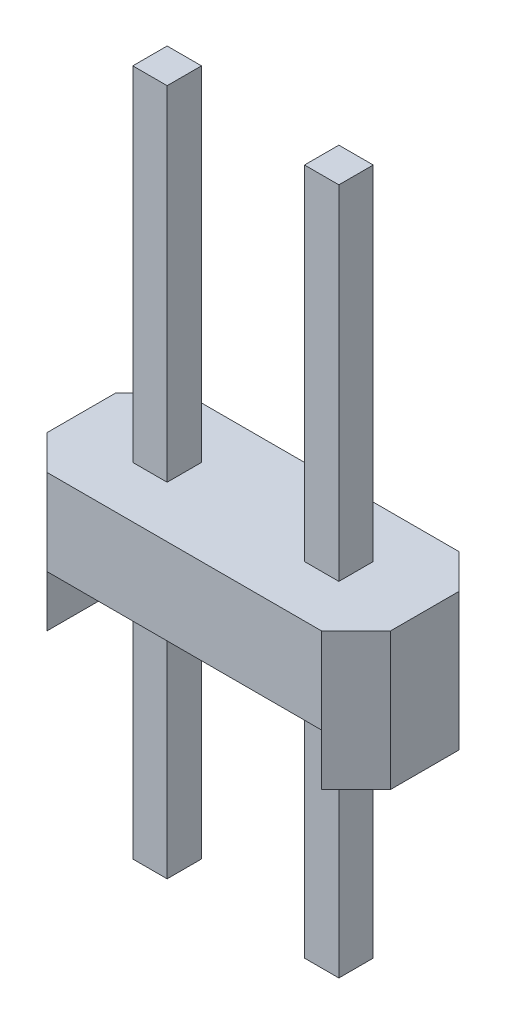
ISO-10303-21;
HEADER;
FILE_DESCRIPTION(('STEP AP214'),'2;1');
FILE_NAME('part.step','',(''),(''),'','','');
FILE_SCHEMA(('AUTOMOTIVE_DESIGN { 1 0 10303 214 1 1 1 1 }'));
ENDSEC;
DATA;
#1=APPLICATION_CONTEXT('core data for automotive mechanical design processes');
#2=APPLICATION_PROTOCOL_DEFINITION('international standard','automotive_design',2000,#1);
#3=PRODUCT_CONTEXT('',#1,'mechanical');
#4=PRODUCT('Part','Part','',(#3));
#5=PRODUCT_RELATED_PRODUCT_CATEGORY('part','',(#4));
#6=PRODUCT_DEFINITION_FORMATION('','',#4);
#7=PRODUCT_DEFINITION_CONTEXT('part definition',#1,'design');
#8=PRODUCT_DEFINITION('design','',#6,#7);
#9=PRODUCT_DEFINITION_SHAPE('','',#8);
#10=(LENGTH_UNIT() NAMED_UNIT(*) SI_UNIT(.MILLI.,.METRE.));
#11=(NAMED_UNIT(*) PLANE_ANGLE_UNIT() SI_UNIT($,.RADIAN.));
#12=(NAMED_UNIT(*) SI_UNIT($,.STERADIAN.) SOLID_ANGLE_UNIT());
#13=UNCERTAINTY_MEASURE_WITH_UNIT(LENGTH_MEASURE(1.E-05),#10,'distance_accuracy_value','');
#14=(GEOMETRIC_REPRESENTATION_CONTEXT(3) GLOBAL_UNCERTAINTY_ASSIGNED_CONTEXT((#13)) GLOBAL_UNIT_ASSIGNED_CONTEXT((#10,
#11,#12)) REPRESENTATION_CONTEXT('',''));
#15=CARTESIAN_POINT('',(0.,0.,0.));
#16=DIRECTION('',(0.,0.,1.));
#17=DIRECTION('',(1.,0.,0.));
#18=AXIS2_PLACEMENT_3D('',#15,#16,#17);
#19=CARTESIAN_POINT('',(0.,0.,0.));
#20=DIRECTION('',(0.,-1.,0.));
#21=DIRECTION('',(0.,0.,-1.));
#22=AXIS2_PLACEMENT_3D('',#19,#20,#21);
#23=PLANE('',#22);
#24=DIRECTION('',(0.,0.,1.));
#25=VECTOR('',#24,1.);
#26=CARTESIAN_POINT('',(0.,0.,0.));
#27=LINE('',#26,#25);
#28=CARTESIAN_POINT('',(0.,0.,-1.5));
#29=VERTEX_POINT('',#28);
#30=CARTESIAN_POINT('',(0.,0.,-0.500000000000001));
#31=VERTEX_POINT('',#30);
#32=EDGE_CURVE('E334',#29,#31,#27,.T.);
#33=ORIENTED_EDGE('',*,*,#32,.F.);
#34=DIRECTION('',(-0.707106781186549,0.,0.707106781186546));
#35=VECTOR('',#34,1.);
#36=CARTESIAN_POINT('',(-0.75,0.,-0.750000000000002));
#37=LINE('',#36,#35);
#38=CARTESIAN_POINT('',(0.5,0.,-2.));
#39=VERTEX_POINT('',#38);
#40=EDGE_CURVE('E393',#29,#39,#37,.F.);
#41=ORIENTED_EDGE('',*,*,#40,.T.);
#42=DIRECTION('',(0.,0.,1.));
#43=VECTOR('',#42,1.);
#44=CARTESIAN_POINT('',(0.5,0.,-2.));
#45=LINE('',#44,#43);
#46=CARTESIAN_POINT('',(0.5,0.,0.));
#47=VERTEX_POINT('',#46);
#48=EDGE_CURVE('E324',#39,#47,#45,.T.);
#49=ORIENTED_EDGE('',*,*,#48,.T.);
#50=DIRECTION('',(0.707106781186546,0.,0.707106781186549));
#51=VECTOR('',#50,1.);
#52=CARTESIAN_POINT('',(0.250000000000001,0.,-0.249999999999999));
#53=LINE('',#52,#51);
#54=EDGE_CURVE('E391',#47,#31,#53,.F.);
#55=ORIENTED_EDGE('',*,*,#54,.T.);
#56=EDGE_LOOP('',(#33,#41,#49,#55));
#57=FACE_BOUND('',#56,.T.);
#58=ADVANCED_FACE('F34',(#57),#23,.T.);
#59=CARTESIAN_POINT('',(0.,2.,0.));
#60=DIRECTION('',(1.,0.,0.));
#61=DIRECTION('',(0.,0.,-1.));
#62=AXIS2_PLACEMENT_3D('',#59,#60,#61);
#63=PLANE('',#62);
#64=DIRECTION('',(0.,0.,1.));
#65=VECTOR('',#64,1.);
#66=CARTESIAN_POINT('',(0.,2.,0.));
#67=LINE('',#66,#65);
#68=CARTESIAN_POINT('',(0.,2.,-1.5));
#69=VERTEX_POINT('',#68);
#70=CARTESIAN_POINT('',(0.,2.,-0.500000000000001));
#71=VERTEX_POINT('',#70);
#72=EDGE_CURVE('E342',#69,#71,#67,.T.);
#73=ORIENTED_EDGE('',*,*,#72,.F.);
#74=DIRECTION('',(0.,-1.,0.));
#75=VECTOR('',#74,1.);
#76=CARTESIAN_POINT('',(0.,2.,-1.5));
#77=LINE('',#76,#75);
#78=EDGE_CURVE('E388',#69,#29,#77,.T.);
#79=ORIENTED_EDGE('',*,*,#78,.T.);
#80=ORIENTED_EDGE('',*,*,#32,.T.);
#81=DIRECTION('',(0.,1.,0.));
#82=VECTOR('',#81,1.);
#83=CARTESIAN_POINT('',(0.,2.,-0.500000000000001));
#84=LINE('',#83,#82);
#85=EDGE_CURVE('E386',#31,#71,#84,.T.);
#86=ORIENTED_EDGE('',*,*,#85,.T.);
#87=EDGE_LOOP('',(#73,#79,#80,#86));
#88=FACE_BOUND('',#87,.T.);
#89=ADVANCED_FACE('F442',(#88),#63,.F.);
#90=CARTESIAN_POINT('',(0.,2.,0.));
#91=DIRECTION('',(0.,0.,-1.));
#92=DIRECTION('',(-1.,0.,0.));
#93=AXIS2_PLACEMENT_3D('',#90,#91,#92);
#94=PLANE('',#93);
#95=DIRECTION('',(-1.,0.,0.));
#96=VECTOR('',#95,1.);
#97=CARTESIAN_POINT('',(0.5,0.75,0.));
#98=LINE('',#97,#96);
#99=CARTESIAN_POINT('',(4.5,0.75,0.));
#100=VERTEX_POINT('',#99);
#101=CARTESIAN_POINT('',(0.5,0.75,0.));
#102=VERTEX_POINT('',#101);
#103=EDGE_CURVE('E319',#100,#102,#98,.T.);
#104=ORIENTED_EDGE('',*,*,#103,.F.);
#105=DIRECTION('',(0.,1.,0.));
#106=VECTOR('',#105,1.);
#107=CARTESIAN_POINT('',(4.5,2.,0.));
#108=LINE('',#107,#106);
#109=CARTESIAN_POINT('',(4.5,2.,0.));
#110=VERTEX_POINT('',#109);
#111=EDGE_CURVE('E371',#100,#110,#108,.T.);
#112=ORIENTED_EDGE('',*,*,#111,.T.);
#113=DIRECTION('',(1.,0.,0.));
#114=VECTOR('',#113,1.);
#115=CARTESIAN_POINT('',(0.,2.,0.));
#116=LINE('',#115,#114);
#117=CARTESIAN_POINT('',(0.499999999999999,2.,0.));
#118=VERTEX_POINT('',#117);
#119=EDGE_CURVE('E345',#118,#110,#116,.T.);
#120=ORIENTED_EDGE('',*,*,#119,.F.);
#121=DIRECTION('',(0.,-1.,0.));
#122=VECTOR('',#121,1.);
#123=CARTESIAN_POINT('',(0.499999999999999,2.,0.));
#124=LINE('',#123,#122);
#125=EDGE_CURVE('E368',#118,#102,#124,.T.);
#126=ORIENTED_EDGE('',*,*,#125,.T.);
#127=EDGE_LOOP('',(#104,#112,#120,#126));
#128=FACE_BOUND('',#127,.T.);
#129=ADVANCED_FACE('F449',(#128),#94,.F.);
#130=CARTESIAN_POINT('',(5.,2.,0.));
#131=DIRECTION('',(-1.,0.,0.));
#132=DIRECTION('',(0.,0.,1.));
#133=AXIS2_PLACEMENT_3D('',#130,#131,#132);
#134=PLANE('',#133);
#135=DIRECTION('',(0.,0.,-1.));
#136=VECTOR('',#135,1.);
#137=CARTESIAN_POINT('',(5.,2.,0.));
#138=LINE('',#137,#136);
#139=CARTESIAN_POINT('',(5.,2.,-0.5));
#140=VERTEX_POINT('',#139);
#141=CARTESIAN_POINT('',(5.,2.,-1.5));
#142=VERTEX_POINT('',#141);
#143=EDGE_CURVE('E349',#140,#142,#138,.T.);
#144=ORIENTED_EDGE('',*,*,#143,.F.);
#145=DIRECTION('',(0.,-1.,0.));
#146=VECTOR('',#145,1.);
#147=CARTESIAN_POINT('',(5.,2.,-0.5));
#148=LINE('',#147,#146);
#149=CARTESIAN_POINT('',(5.,0.,-0.500000000000002));
#150=VERTEX_POINT('',#149);
#151=EDGE_CURVE('E361',#140,#150,#148,.T.);
#152=ORIENTED_EDGE('',*,*,#151,.T.);
#153=DIRECTION('',(0.,0.,-1.));
#154=VECTOR('',#153,1.);
#155=CARTESIAN_POINT('',(5.,0.,0.));
#156=LINE('',#155,#154);
#157=CARTESIAN_POINT('',(5.,0.,-1.5));
#158=VERTEX_POINT('',#157);
#159=EDGE_CURVE('E346',#150,#158,#156,.T.);
#160=ORIENTED_EDGE('',*,*,#159,.T.);
#161=DIRECTION('',(0.,1.,0.));
#162=VECTOR('',#161,1.);
#163=CARTESIAN_POINT('',(5.,2.,-1.5));
#164=LINE('',#163,#162);
#165=EDGE_CURVE('E355',#158,#142,#164,.T.);
#166=ORIENTED_EDGE('',*,*,#165,.T.);
#167=EDGE_LOOP('',(#144,#152,#160,#166));
#168=FACE_BOUND('',#167,.T.);
#169=ADVANCED_FACE('F473',(#168),#134,.F.);
#170=CARTESIAN_POINT('',(0.,2.,-2.));
#171=DIRECTION('',(0.,0.,1.));
#172=DIRECTION('',(1.,0.,0.));
#173=AXIS2_PLACEMENT_3D('',#170,#171,#172);
#174=PLANE('',#173);
#175=DIRECTION('',(-1.,0.,0.));
#176=VECTOR('',#175,1.);
#177=CARTESIAN_POINT('',(0.,2.,-2.));
#178=LINE('',#177,#176);
#179=CARTESIAN_POINT('',(4.5,2.,-2.));
#180=VERTEX_POINT('',#179);
#181=CARTESIAN_POINT('',(0.500000000000003,2.,-2.));
#182=VERTEX_POINT('',#181);
#183=EDGE_CURVE('E352',#180,#182,#178,.T.);
#184=ORIENTED_EDGE('',*,*,#183,.F.);
#185=DIRECTION('',(0.,-1.,0.));
#186=VECTOR('',#185,1.);
#187=CARTESIAN_POINT('',(4.5,2.,-2.));
#188=LINE('',#187,#186);
#189=CARTESIAN_POINT('',(4.5,0.75,-2.));
#190=VERTEX_POINT('',#189);
#191=EDGE_CURVE('E383',#180,#190,#188,.T.);
#192=ORIENTED_EDGE('',*,*,#191,.T.);
#193=DIRECTION('',(-1.,0.,0.));
#194=VECTOR('',#193,1.);
#195=CARTESIAN_POINT('',(0.5,0.75,-2.));
#196=LINE('',#195,#194);
#197=CARTESIAN_POINT('',(0.5,0.75,-2.));
#198=VERTEX_POINT('',#197);
#199=EDGE_CURVE('E321',#190,#198,#196,.T.);
#200=ORIENTED_EDGE('',*,*,#199,.T.);
#201=DIRECTION('',(0.,1.,0.));
#202=VECTOR('',#201,1.);
#203=CARTESIAN_POINT('',(0.500000000000003,2.,-2.));
#204=LINE('',#203,#202);
#205=EDGE_CURVE('E381',#198,#182,#204,.T.);
#206=ORIENTED_EDGE('',*,*,#205,.T.);
#207=EDGE_LOOP('',(#184,#192,#200,#206));
#208=FACE_BOUND('',#207,.T.);
#209=ADVANCED_FACE('F465',(#208),#174,.F.);
#210=CARTESIAN_POINT('',(0.,2.,0.));
#211=DIRECTION('',(0.,-1.,0.));
#212=DIRECTION('',(0.,0.,-1.));
#213=AXIS2_PLACEMENT_3D('',#210,#211,#212);
#214=PLANE('',#213);
#215=DIRECTION('',(-1.,0.,0.));
#216=VECTOR('',#215,1.);
#217=CARTESIAN_POINT('',(0.,2.,-0.749999999999999));
#218=LINE('',#217,#216);
#219=CARTESIAN_POINT('',(4.,2.,-0.749999999999999));
#220=VERTEX_POINT('',#219);
#221=CARTESIAN_POINT('',(3.5,2.,-0.749999999999999));
#222=VERTEX_POINT('',#221);
#223=EDGE_CURVE('E247',#220,#222,#218,.T.);
#224=ORIENTED_EDGE('',*,*,#223,.T.);
#225=DIRECTION('',(0.,0.,-1.));
#226=VECTOR('',#225,1.);
#227=CARTESIAN_POINT('',(3.5,2.,0.));
#228=LINE('',#227,#226);
#229=CARTESIAN_POINT('',(3.5,2.,-1.25));
#230=VERTEX_POINT('',#229);
#231=EDGE_CURVE('E211',#222,#230,#228,.T.);
#232=ORIENTED_EDGE('',*,*,#231,.T.);
#233=DIRECTION('',(1.,0.,0.));
#234=VECTOR('',#233,1.);
#235=CARTESIAN_POINT('',(0.,2.,-1.25));
#236=LINE('',#235,#234);
#237=CARTESIAN_POINT('',(4.,2.,-1.25));
#238=VERTEX_POINT('',#237);
#239=EDGE_CURVE('E259',#230,#238,#236,.T.);
#240=ORIENTED_EDGE('',*,*,#239,.T.);
#241=DIRECTION('',(0.,0.,1.));
#242=VECTOR('',#241,1.);
#243=CARTESIAN_POINT('',(4.,2.,0.));
#244=LINE('',#243,#242);
#245=EDGE_CURVE('E256',#238,#220,#244,.T.);
#246=ORIENTED_EDGE('',*,*,#245,.T.);
#247=EDGE_LOOP('',(#224,#232,#240,#246));
#248=FACE_BOUND('',#247,.T.);
#249=DIRECTION('',(-1.,0.,0.));
#250=VECTOR('',#249,1.);
#251=CARTESIAN_POINT('',(0.,2.,-0.749999999999999));
#252=LINE('',#251,#250);
#253=CARTESIAN_POINT('',(1.5,2.,-0.749999999999999));
#254=VERTEX_POINT('',#253);
#255=CARTESIAN_POINT('',(1.,2.,-0.749999999999999));
#256=VERTEX_POINT('',#255);
#257=EDGE_CURVE('E291',#254,#256,#252,.T.);
#258=ORIENTED_EDGE('',*,*,#257,.T.);
#259=DIRECTION('',(0.,0.,-1.));
#260=VECTOR('',#259,1.);
#261=CARTESIAN_POINT('',(1.,2.,0.));
#262=LINE('',#261,#260);
#263=CARTESIAN_POINT('',(1.,2.,-1.25));
#264=VERTEX_POINT('',#263);
#265=EDGE_CURVE('E311',#256,#264,#262,.T.);
#266=ORIENTED_EDGE('',*,*,#265,.T.);
#267=DIRECTION('',(1.,0.,0.));
#268=VECTOR('',#267,1.);
#269=CARTESIAN_POINT('',(0.,2.,-1.25));
#270=LINE('',#269,#268);
#271=CARTESIAN_POINT('',(1.5,2.,-1.25));
#272=VERTEX_POINT('',#271);
#273=EDGE_CURVE('E308',#264,#272,#270,.T.);
#274=ORIENTED_EDGE('',*,*,#273,.T.);
#275=DIRECTION('',(0.,0.,1.));
#276=VECTOR('',#275,1.);
#277=CARTESIAN_POINT('',(1.5,2.,0.));
#278=LINE('',#277,#276);
#279=EDGE_CURVE('E305',#272,#254,#278,.T.);
#280=ORIENTED_EDGE('',*,*,#279,.T.);
#281=EDGE_LOOP('',(#258,#266,#274,#280));
#282=FACE_BOUND('',#281,.T.);
#283=ORIENTED_EDGE('',*,*,#119,.T.);
#284=DIRECTION('',(-0.707106781186549,0.,0.707106781186546));
#285=VECTOR('',#284,1.);
#286=CARTESIAN_POINT('',(5.,2.,-0.5));
#287=LINE('',#286,#285);
#288=EDGE_CURVE('E379',#110,#140,#287,.F.);
#289=ORIENTED_EDGE('',*,*,#288,.T.);
#290=ORIENTED_EDGE('',*,*,#143,.T.);
#291=DIRECTION('',(0.707106781186546,0.,0.707106781186549));
#292=VECTOR('',#291,1.);
#293=CARTESIAN_POINT('',(4.5,2.,-2.));
#294=LINE('',#293,#292);
#295=EDGE_CURVE('E377',#142,#180,#294,.F.);
#296=ORIENTED_EDGE('',*,*,#295,.T.);
#297=ORIENTED_EDGE('',*,*,#183,.T.);
#298=DIRECTION('',(0.707106781186549,0.,-0.707106781186546));
#299=VECTOR('',#298,1.);
#300=CARTESIAN_POINT('',(0.,2.,-1.5));
#301=LINE('',#300,#299);
#302=EDGE_CURVE('E375',#182,#69,#301,.F.);
#303=ORIENTED_EDGE('',*,*,#302,.T.);
#304=ORIENTED_EDGE('',*,*,#72,.T.);
#305=DIRECTION('',(-0.707106781186546,0.,-0.707106781186549));
#306=VECTOR('',#305,1.);
#307=CARTESIAN_POINT('',(0.499999999999999,2.,0.));
#308=LINE('',#307,#306);
#309=EDGE_CURVE('E373',#71,#118,#308,.F.);
#310=ORIENTED_EDGE('',*,*,#309,.T.);
#311=EDGE_LOOP('',(#283,#289,#290,#296,#297,#303,#304,#310));
#312=FACE_BOUND('',#311,.T.);
#313=ADVANCED_FACE('F457',(#248,#282,#312),#214,.F.);
#314=ORIENTED_EDGE('',*,*,#159,.F.);
#315=DIRECTION('',(0.707106781186549,0.,-0.707106781186546));
#316=VECTOR('',#315,1.);
#317=CARTESIAN_POINT('',(2.24999999999999,0.,2.25));
#318=LINE('',#317,#316);
#319=CARTESIAN_POINT('',(4.5,0.,0.));
#320=VERTEX_POINT('',#319);
#321=EDGE_CURVE('E366',#150,#320,#318,.F.);
#322=ORIENTED_EDGE('',*,*,#321,.T.);
#323=DIRECTION('',(0.,0.,1.));
#324=VECTOR('',#323,1.);
#325=CARTESIAN_POINT('',(4.5,0.,-2.));
#326=LINE('',#325,#324);
#327=CARTESIAN_POINT('',(4.5,0.,-2.));
#328=VERTEX_POINT('',#327);
#329=EDGE_CURVE('E337',#328,#320,#326,.T.);
#330=ORIENTED_EDGE('',*,*,#329,.F.);
#331=DIRECTION('',(-0.707106781186546,0.,-0.707106781186549));
#332=VECTOR('',#331,1.);
#333=CARTESIAN_POINT('',(3.25000000000001,0.,-3.25));
#334=LINE('',#333,#332);
#335=EDGE_CURVE('E364',#328,#158,#334,.F.);
#336=ORIENTED_EDGE('',*,*,#335,.T.);
#337=EDGE_LOOP('',(#314,#322,#330,#336));
#338=FACE_BOUND('',#337,.T.);
#339=ADVANCED_FACE('F445',(#338),#23,.T.);
#340=CARTESIAN_POINT('',(0.5,0.,-2.));
#341=DIRECTION('',(-1.,0.,0.));
#342=DIRECTION('',(0.,0.,1.));
#343=AXIS2_PLACEMENT_3D('',#340,#341,#342);
#344=PLANE('',#343);
#345=DIRECTION('',(0.,-1.,0.));
#346=VECTOR('',#345,1.);
#347=CARTESIAN_POINT('',(0.5,0.,0.));
#348=LINE('',#347,#346);
#349=EDGE_CURVE('E314',#102,#47,#348,.T.);
#350=ORIENTED_EDGE('',*,*,#349,.T.);
#351=ORIENTED_EDGE('',*,*,#48,.F.);
#352=DIRECTION('',(0.,-1.,0.));
#353=VECTOR('',#352,1.);
#354=CARTESIAN_POINT('',(0.5,0.,-2.));
#355=LINE('',#354,#353);
#356=EDGE_CURVE('E315',#198,#39,#355,.T.);
#357=ORIENTED_EDGE('',*,*,#356,.F.);
#358=DIRECTION('',(0.,0.,1.));
#359=VECTOR('',#358,1.);
#360=CARTESIAN_POINT('',(0.5,0.75,-2.));
#361=LINE('',#360,#359);
#362=EDGE_CURVE('E331',#198,#102,#361,.T.);
#363=ORIENTED_EDGE('',*,*,#362,.T.);
#364=EDGE_LOOP('',(#350,#351,#357,#363));
#365=FACE_BOUND('',#364,.T.);
#366=ADVANCED_FACE('F456',(#365),#344,.F.);
#367=CARTESIAN_POINT('',(0.5,0.75,-2.));
#368=DIRECTION('',(0.,1.,0.));
#369=DIRECTION('',(0.,0.,1.));
#370=AXIS2_PLACEMENT_3D('',#367,#368,#369);
#371=PLANE('',#370);
#372=DIRECTION('',(-1.,0.,0.));
#373=VECTOR('',#372,1.);
#374=CARTESIAN_POINT('',(0.5,0.75,-1.25));
#375=LINE('',#374,#373);
#376=CARTESIAN_POINT('',(4.,0.75,-1.25));
#377=VERTEX_POINT('',#376);
#378=CARTESIAN_POINT('',(3.5,0.75,-1.25));
#379=VERTEX_POINT('',#378);
#380=EDGE_CURVE('E42',#377,#379,#375,.T.);
#381=ORIENTED_EDGE('',*,*,#380,.T.);
#382=DIRECTION('',(0.,0.,1.));
#383=VECTOR('',#382,1.);
#384=CARTESIAN_POINT('',(3.5,0.75,-2.));
#385=LINE('',#384,#383);
#386=CARTESIAN_POINT('',(3.5,0.75,-0.749999999999999));
#387=VERTEX_POINT('',#386);
#388=EDGE_CURVE('E11',#379,#387,#385,.T.);
#389=ORIENTED_EDGE('',*,*,#388,.T.);
#390=DIRECTION('',(1.,0.,0.));
#391=VECTOR('',#390,1.);
#392=CARTESIAN_POINT('',(0.5,0.75,-0.749999999999999));
#393=LINE('',#392,#391);
#394=CARTESIAN_POINT('',(4.,0.75,-0.749999999999999));
#395=VERTEX_POINT('',#394);
#396=EDGE_CURVE('E407',#387,#395,#393,.T.);
#397=ORIENTED_EDGE('',*,*,#396,.T.);
#398=DIRECTION('',(0.,0.,-1.));
#399=VECTOR('',#398,1.);
#400=CARTESIAN_POINT('',(4.,0.75,-2.));
#401=LINE('',#400,#399);
#402=EDGE_CURVE('E410',#395,#377,#401,.T.);
#403=ORIENTED_EDGE('',*,*,#402,.T.);
#404=EDGE_LOOP('',(#381,#389,#397,#403));
#405=FACE_BOUND('',#404,.T.);
#406=DIRECTION('',(-1.,0.,0.));
#407=VECTOR('',#406,1.);
#408=CARTESIAN_POINT('',(0.5,0.75,-1.25));
#409=LINE('',#408,#407);
#410=CARTESIAN_POINT('',(1.5,0.75,-1.25));
#411=VERTEX_POINT('',#410);
#412=CARTESIAN_POINT('',(1.,0.75,-1.25));
#413=VERTEX_POINT('',#412);
#414=EDGE_CURVE('E401',#411,#413,#409,.T.);
#415=ORIENTED_EDGE('',*,*,#414,.T.);
#416=DIRECTION('',(0.,0.,1.));
#417=VECTOR('',#416,1.);
#418=CARTESIAN_POINT('',(1.,0.75,-2.));
#419=LINE('',#418,#417);
#420=CARTESIAN_POINT('',(1.,0.75,-0.749999999999999));
#421=VERTEX_POINT('',#420);
#422=EDGE_CURVE('E404',#413,#421,#419,.T.);
#423=ORIENTED_EDGE('',*,*,#422,.T.);
#424=DIRECTION('',(1.,0.,0.));
#425=VECTOR('',#424,1.);
#426=CARTESIAN_POINT('',(0.5,0.75,-0.749999999999999));
#427=LINE('',#426,#425);
#428=CARTESIAN_POINT('',(1.5,0.75,-0.749999999999999));
#429=VERTEX_POINT('',#428);
#430=EDGE_CURVE('E395',#421,#429,#427,.T.);
#431=ORIENTED_EDGE('',*,*,#430,.T.);
#432=DIRECTION('',(0.,0.,-1.));
#433=VECTOR('',#432,1.);
#434=CARTESIAN_POINT('',(1.5,0.75,-2.));
#435=LINE('',#434,#433);
#436=EDGE_CURVE('E398',#429,#411,#435,.T.);
#437=ORIENTED_EDGE('',*,*,#436,.T.);
#438=EDGE_LOOP('',(#415,#423,#431,#437));
#439=FACE_BOUND('',#438,.T.);
#440=ORIENTED_EDGE('',*,*,#103,.T.);
#441=ORIENTED_EDGE('',*,*,#362,.F.);
#442=ORIENTED_EDGE('',*,*,#199,.F.);
#443=DIRECTION('',(0.,0.,1.));
#444=VECTOR('',#443,1.);
#445=CARTESIAN_POINT('',(4.5,0.75,-2.));
#446=LINE('',#445,#444);
#447=EDGE_CURVE('E335',#190,#100,#446,.T.);
#448=ORIENTED_EDGE('',*,*,#447,.T.);
#449=EDGE_LOOP('',(#440,#441,#442,#448));
#450=FACE_BOUND('',#449,.T.);
#451=ADVANCED_FACE('F414',(#405,#439,#450),#371,.F.);
#452=CARTESIAN_POINT('',(4.5,0.,-2.));
#453=DIRECTION('',(1.,0.,0.));
#454=DIRECTION('',(0.,0.,-1.));
#455=AXIS2_PLACEMENT_3D('',#452,#453,#454);
#456=PLANE('',#455);
#457=DIRECTION('',(0.,1.,0.));
#458=VECTOR('',#457,1.);
#459=CARTESIAN_POINT('',(4.5,0.,0.));
#460=LINE('',#459,#458);
#461=EDGE_CURVE('E326',#320,#100,#460,.T.);
#462=ORIENTED_EDGE('',*,*,#461,.T.);
#463=ORIENTED_EDGE('',*,*,#447,.F.);
#464=DIRECTION('',(0.,1.,0.));
#465=VECTOR('',#464,1.);
#466=CARTESIAN_POINT('',(4.5,0.,-2.));
#467=LINE('',#466,#465);
#468=EDGE_CURVE('E318',#328,#190,#467,.T.);
#469=ORIENTED_EDGE('',*,*,#468,.F.);
#470=ORIENTED_EDGE('',*,*,#329,.T.);
#471=EDGE_LOOP('',(#462,#463,#469,#470));
#472=FACE_BOUND('',#471,.T.);
#473=ADVANCED_FACE('F505',(#472),#456,.F.);
#474=CARTESIAN_POINT('',(5.,2.,-0.5));
#475=DIRECTION('',(-0.707106781186546,0.,-0.707106781186549));
#476=DIRECTION('',(0.,-1.,0.));
#477=AXIS2_PLACEMENT_3D('',#474,#475,#476);
#478=PLANE('',#477);
#479=ORIENTED_EDGE('',*,*,#111,.F.);
#480=ORIENTED_EDGE('',*,*,#461,.F.);
#481=ORIENTED_EDGE('',*,*,#321,.F.);
#482=ORIENTED_EDGE('',*,*,#151,.F.);
#483=ORIENTED_EDGE('',*,*,#288,.F.);
#484=EDGE_LOOP('',(#479,#480,#481,#482,#483));
#485=FACE_BOUND('',#484,.T.);
#486=ADVANCED_FACE('F503',(#485),#478,.F.);
#487=CARTESIAN_POINT('',(4.5,2.,-2.));
#488=DIRECTION('',(-0.707106781186549,0.,0.707106781186546));
#489=DIRECTION('',(0.,-1.,0.));
#490=AXIS2_PLACEMENT_3D('',#487,#488,#489);
#491=PLANE('',#490);
#492=ORIENTED_EDGE('',*,*,#295,.F.);
#493=ORIENTED_EDGE('',*,*,#165,.F.);
#494=ORIENTED_EDGE('',*,*,#335,.F.);
#495=ORIENTED_EDGE('',*,*,#468,.T.);
#496=ORIENTED_EDGE('',*,*,#191,.F.);
#497=EDGE_LOOP('',(#492,#493,#494,#495,#496));
#498=FACE_BOUND('',#497,.T.);
#499=ADVANCED_FACE('F477',(#498),#491,.F.);
#500=CARTESIAN_POINT('',(0.,2.,-1.5));
#501=DIRECTION('',(0.707106781186546,0.,0.707106781186549));
#502=DIRECTION('',(0.,-1.,0.));
#503=AXIS2_PLACEMENT_3D('',#500,#501,#502);
#504=PLANE('',#503);
#505=ORIENTED_EDGE('',*,*,#205,.F.);
#506=ORIENTED_EDGE('',*,*,#356,.T.);
#507=ORIENTED_EDGE('',*,*,#40,.F.);
#508=ORIENTED_EDGE('',*,*,#78,.F.);
#509=ORIENTED_EDGE('',*,*,#302,.F.);
#510=EDGE_LOOP('',(#505,#506,#507,#508,#509));
#511=FACE_BOUND('',#510,.T.);
#512=ADVANCED_FACE('F487',(#511),#504,.F.);
#513=CARTESIAN_POINT('',(0.499999999999999,2.,0.));
#514=DIRECTION('',(0.707106781186549,0.,-0.707106781186546));
#515=DIRECTION('',(0.,-1.,0.));
#516=AXIS2_PLACEMENT_3D('',#513,#514,#515);
#517=PLANE('',#516);
#518=ORIENTED_EDGE('',*,*,#309,.F.);
#519=ORIENTED_EDGE('',*,*,#85,.F.);
#520=ORIENTED_EDGE('',*,*,#54,.F.);
#521=ORIENTED_EDGE('',*,*,#349,.F.);
#522=ORIENTED_EDGE('',*,*,#125,.F.);
#523=EDGE_LOOP('',(#518,#519,#520,#521,#522));
#524=FACE_BOUND('',#523,.T.);
#525=ADVANCED_FACE('F36',(#524),#517,.F.);
#526=CARTESIAN_POINT('',(0.,-3.,0.));
#527=DIRECTION('',(0.,1.,0.));
#528=DIRECTION('',(0.,0.,1.));
#529=AXIS2_PLACEMENT_3D('',#526,#527,#528);
#530=PLANE('',#529);
#531=DIRECTION('',(0.,0.,1.));
#532=VECTOR('',#531,1.);
#533=CARTESIAN_POINT('',(1.,-3.,-1.25));
#534=LINE('',#533,#532);
#535=CARTESIAN_POINT('',(1.,-3.,-1.25));
#536=VERTEX_POINT('',#535);
#537=CARTESIAN_POINT('',(1.,-3.,-0.749999999999999));
#538=VERTEX_POINT('',#537);
#539=EDGE_CURVE('E275',#536,#538,#534,.T.);
#540=ORIENTED_EDGE('',*,*,#539,.F.);
#541=DIRECTION('',(-1.,0.,0.));
#542=VECTOR('',#541,1.);
#543=CARTESIAN_POINT('',(1.,-3.,-1.25));
#544=LINE('',#543,#542);
#545=CARTESIAN_POINT('',(1.5,-3.,-1.25));
#546=VERTEX_POINT('',#545);
#547=EDGE_CURVE('E284',#546,#536,#544,.T.);
#548=ORIENTED_EDGE('',*,*,#547,.F.);
#549=DIRECTION('',(0.,0.,-1.));
#550=VECTOR('',#549,1.);
#551=CARTESIAN_POINT('',(1.5,-3.,-1.25));
#552=LINE('',#551,#550);
#553=CARTESIAN_POINT('',(1.5,-3.,-0.749999999999999));
#554=VERTEX_POINT('',#553);
#555=EDGE_CURVE('E281',#554,#546,#552,.T.);
#556=ORIENTED_EDGE('',*,*,#555,.F.);
#557=DIRECTION('',(1.,0.,0.));
#558=VECTOR('',#557,1.);
#559=CARTESIAN_POINT('',(1.,-3.,-0.749999999999999));
#560=LINE('',#559,#558);
#561=EDGE_CURVE('E278',#538,#554,#560,.T.);
#562=ORIENTED_EDGE('',*,*,#561,.F.);
#563=EDGE_LOOP('',(#540,#548,#556,#562));
#564=FACE_BOUND('',#563,.T.);
#565=ADVANCED_FACE('F535',(#564),#530,.F.);
#566=CARTESIAN_POINT('',(1.,-3.,-0.749999999999999));
#567=DIRECTION('',(0.,0.,1.));
#568=DIRECTION('',(1.,0.,0.));
#569=AXIS2_PLACEMENT_3D('',#566,#567,#568);
#570=PLANE('',#569);
#571=ORIENTED_EDGE('',*,*,#430,.F.);
#572=DIRECTION('',(0.,1.,0.));
#573=VECTOR('',#572,1.);
#574=CARTESIAN_POINT('',(1.,-3.,-0.749999999999999));
#575=LINE('',#574,#573);
#576=EDGE_CURVE('E300',#538,#421,#575,.T.);
#577=ORIENTED_EDGE('',*,*,#576,.F.);
#578=ORIENTED_EDGE('',*,*,#561,.T.);
#579=DIRECTION('',(0.,1.,0.));
#580=VECTOR('',#579,1.);
#581=CARTESIAN_POINT('',(1.5,-3.,-0.749999999999999));
#582=LINE('',#581,#580);
#583=EDGE_CURVE('E297',#554,#429,#582,.T.);
#584=ORIENTED_EDGE('',*,*,#583,.T.);
#585=EDGE_LOOP('',(#571,#577,#578,#584));
#586=FACE_BOUND('',#585,.T.);
#587=ADVANCED_FACE('F526',(#586),#570,.T.);
#588=CARTESIAN_POINT('',(1.5,-3.,-1.25));
#589=DIRECTION('',(1.,0.,0.));
#590=DIRECTION('',(0.,0.,-1.));
#591=AXIS2_PLACEMENT_3D('',#588,#589,#590);
#592=PLANE('',#591);
#593=ORIENTED_EDGE('',*,*,#436,.F.);
#594=ORIENTED_EDGE('',*,*,#583,.F.);
#595=ORIENTED_EDGE('',*,*,#555,.T.);
#596=DIRECTION('',(0.,1.,0.));
#597=VECTOR('',#596,1.);
#598=CARTESIAN_POINT('',(1.5,-3.,-1.25));
#599=LINE('',#598,#597);
#600=EDGE_CURVE('E293',#546,#411,#599,.T.);
#601=ORIENTED_EDGE('',*,*,#600,.T.);
#602=EDGE_LOOP('',(#593,#594,#595,#601));
#603=FACE_BOUND('',#602,.T.);
#604=ADVANCED_FACE('F530',(#603),#592,.T.);
#605=CARTESIAN_POINT('',(1.,-3.,-1.25));
#606=DIRECTION('',(0.,0.,-1.));
#607=DIRECTION('',(-1.,0.,0.));
#608=AXIS2_PLACEMENT_3D('',#605,#606,#607);
#609=PLANE('',#608);
#610=ORIENTED_EDGE('',*,*,#414,.F.);
#611=ORIENTED_EDGE('',*,*,#600,.F.);
#612=ORIENTED_EDGE('',*,*,#547,.T.);
#613=DIRECTION('',(0.,1.,0.));
#614=VECTOR('',#613,1.);
#615=CARTESIAN_POINT('',(1.,-3.,-1.25));
#616=LINE('',#615,#614);
#617=EDGE_CURVE('E288',#536,#413,#616,.T.);
#618=ORIENTED_EDGE('',*,*,#617,.T.);
#619=EDGE_LOOP('',(#610,#611,#612,#618));
#620=FACE_BOUND('',#619,.T.);
#621=ADVANCED_FACE('F534',(#620),#609,.T.);
#622=CARTESIAN_POINT('',(1.,-3.,-1.25));
#623=DIRECTION('',(-1.,0.,0.));
#624=DIRECTION('',(0.,0.,1.));
#625=AXIS2_PLACEMENT_3D('',#622,#623,#624);
#626=PLANE('',#625);
#627=ORIENTED_EDGE('',*,*,#422,.F.);
#628=ORIENTED_EDGE('',*,*,#617,.F.);
#629=ORIENTED_EDGE('',*,*,#539,.T.);
#630=ORIENTED_EDGE('',*,*,#576,.T.);
#631=EDGE_LOOP('',(#627,#628,#629,#630));
#632=FACE_BOUND('',#631,.T.);
#633=ADVANCED_FACE('F519',(#632),#626,.T.);
#634=ORIENTED_EDGE('',*,*,#265,.F.);
#635=CARTESIAN_POINT('',(1.,7.,-0.749999999999999));
#636=VERTEX_POINT('',#635);
#637=EDGE_CURVE('E287',#256,#636,#575,.T.);
#638=ORIENTED_EDGE('',*,*,#637,.T.);
#639=DIRECTION('',(0.,0.,1.));
#640=VECTOR('',#639,1.);
#641=CARTESIAN_POINT('',(1.,7.,-1.25));
#642=LINE('',#641,#640);
#643=CARTESIAN_POINT('',(1.,7.,-1.25));
#644=VERTEX_POINT('',#643);
#645=EDGE_CURVE('E263',#644,#636,#642,.T.);
#646=ORIENTED_EDGE('',*,*,#645,.F.);
#647=EDGE_CURVE('E292',#264,#644,#616,.T.);
#648=ORIENTED_EDGE('',*,*,#647,.F.);
#649=EDGE_LOOP('',(#634,#638,#646,#648));
#650=FACE_BOUND('',#649,.T.);
#651=ADVANCED_FACE('F515',(#650),#626,.T.);
#652=ORIENTED_EDGE('',*,*,#273,.F.);
#653=ORIENTED_EDGE('',*,*,#647,.T.);
#654=DIRECTION('',(-1.,0.,0.));
#655=VECTOR('',#654,1.);
#656=CARTESIAN_POINT('',(1.,7.,-1.25));
#657=LINE('',#656,#655);
#658=CARTESIAN_POINT('',(1.5,7.,-1.25));
#659=VERTEX_POINT('',#658);
#660=EDGE_CURVE('E272',#659,#644,#657,.T.);
#661=ORIENTED_EDGE('',*,*,#660,.F.);
#662=EDGE_CURVE('E296',#272,#659,#599,.T.);
#663=ORIENTED_EDGE('',*,*,#662,.F.);
#664=EDGE_LOOP('',(#652,#653,#661,#663));
#665=FACE_BOUND('',#664,.T.);
#666=ADVANCED_FACE('F518',(#665),#609,.T.);
#667=ORIENTED_EDGE('',*,*,#279,.F.);
#668=ORIENTED_EDGE('',*,*,#662,.T.);
#669=DIRECTION('',(0.,0.,-1.));
#670=VECTOR('',#669,1.);
#671=CARTESIAN_POINT('',(1.5,7.,-1.25));
#672=LINE('',#671,#670);
#673=CARTESIAN_POINT('',(1.5,7.,-0.749999999999999));
#674=VERTEX_POINT('',#673);
#675=EDGE_CURVE('E269',#674,#659,#672,.T.);
#676=ORIENTED_EDGE('',*,*,#675,.F.);
#677=EDGE_CURVE('E299',#254,#674,#582,.T.);
#678=ORIENTED_EDGE('',*,*,#677,.F.);
#679=EDGE_LOOP('',(#667,#668,#676,#678));
#680=FACE_BOUND('',#679,.T.);
#681=ADVANCED_FACE('F524',(#680),#592,.T.);
#682=ORIENTED_EDGE('',*,*,#257,.F.);
#683=ORIENTED_EDGE('',*,*,#677,.T.);
#684=DIRECTION('',(1.,0.,0.));
#685=VECTOR('',#684,1.);
#686=CARTESIAN_POINT('',(1.,7.,-0.749999999999999));
#687=LINE('',#686,#685);
#688=EDGE_CURVE('E266',#636,#674,#687,.T.);
#689=ORIENTED_EDGE('',*,*,#688,.F.);
#690=ORIENTED_EDGE('',*,*,#637,.F.);
#691=EDGE_LOOP('',(#682,#683,#689,#690));
#692=FACE_BOUND('',#691,.T.);
#693=ADVANCED_FACE('F521',(#692),#570,.T.);
#694=CARTESIAN_POINT('',(0.,7.,0.));
#695=DIRECTION('',(0.,1.,0.));
#696=DIRECTION('',(0.,0.,1.));
#697=AXIS2_PLACEMENT_3D('',#694,#695,#696);
#698=PLANE('',#697);
#699=ORIENTED_EDGE('',*,*,#645,.T.);
#700=ORIENTED_EDGE('',*,*,#688,.T.);
#701=ORIENTED_EDGE('',*,*,#675,.T.);
#702=ORIENTED_EDGE('',*,*,#660,.T.);
#703=EDGE_LOOP('',(#699,#700,#701,#702));
#704=FACE_BOUND('',#703,.T.);
#705=ADVANCED_FACE('F437',(#704),#698,.T.);
#706=CARTESIAN_POINT('',(0.,-3.,0.));
#707=DIRECTION('',(0.,1.,0.));
#708=DIRECTION('',(0.,0.,1.));
#709=AXIS2_PLACEMENT_3D('',#706,#707,#708);
#710=PLANE('',#709);
#711=DIRECTION('',(0.,0.,1.));
#712=VECTOR('',#711,1.);
#713=CARTESIAN_POINT('',(3.5,-3.,-1.25));
#714=LINE('',#713,#712);
#715=CARTESIAN_POINT('',(3.5,-3.,-1.25));
#716=VERTEX_POINT('',#715);
#717=CARTESIAN_POINT('',(3.5,-3.,-0.749999999999999));
#718=VERTEX_POINT('',#717);
#719=EDGE_CURVE('E234',#716,#718,#714,.T.);
#720=ORIENTED_EDGE('',*,*,#719,.F.);
#721=DIRECTION('',(-1.,0.,0.));
#722=VECTOR('',#721,1.);
#723=CARTESIAN_POINT('',(3.5,-3.,-1.25));
#724=LINE('',#723,#722);
#725=CARTESIAN_POINT('',(4.,-3.,-1.25));
#726=VERTEX_POINT('',#725);
#727=EDGE_CURVE('E214',#726,#716,#724,.T.);
#728=ORIENTED_EDGE('',*,*,#727,.F.);
#729=DIRECTION('',(0.,0.,-1.));
#730=VECTOR('',#729,1.);
#731=CARTESIAN_POINT('',(4.,-3.,-1.25));
#732=LINE('',#731,#730);
#733=CARTESIAN_POINT('',(4.,-3.,-0.749999999999999));
#734=VERTEX_POINT('',#733);
#735=EDGE_CURVE('E239',#734,#726,#732,.T.);
#736=ORIENTED_EDGE('',*,*,#735,.F.);
#737=DIRECTION('',(1.,0.,0.));
#738=VECTOR('',#737,1.);
#739=CARTESIAN_POINT('',(3.5,-3.,-0.749999999999999));
#740=LINE('',#739,#738);
#741=EDGE_CURVE('E237',#718,#734,#740,.T.);
#742=ORIENTED_EDGE('',*,*,#741,.F.);
#743=EDGE_LOOP('',(#720,#728,#736,#742));
#744=FACE_BOUND('',#743,.T.);
#745=ADVANCED_FACE('F425',(#744),#710,.F.);
#746=CARTESIAN_POINT('',(3.5,-3.,-0.749999999999999));
#747=DIRECTION('',(0.,0.,1.));
#748=DIRECTION('',(1.,0.,0.));
#749=AXIS2_PLACEMENT_3D('',#746,#747,#748);
#750=PLANE('',#749);
#751=ORIENTED_EDGE('',*,*,#396,.F.);
#752=DIRECTION('',(0.,1.,0.));
#753=VECTOR('',#752,1.);
#754=CARTESIAN_POINT('',(3.5,-3.,-0.749999999999999));
#755=LINE('',#754,#753);
#756=EDGE_CURVE('E213',#718,#387,#755,.T.);
#757=ORIENTED_EDGE('',*,*,#756,.F.);
#758=ORIENTED_EDGE('',*,*,#741,.T.);
#759=DIRECTION('',(0.,1.,0.));
#760=VECTOR('',#759,1.);
#761=CARTESIAN_POINT('',(4.,-3.,-0.749999999999999));
#762=LINE('',#761,#760);
#763=EDGE_CURVE('E57',#734,#395,#762,.T.);
#764=ORIENTED_EDGE('',*,*,#763,.T.);
#765=EDGE_LOOP('',(#751,#757,#758,#764));
#766=FACE_BOUND('',#765,.T.);
#767=ADVANCED_FACE('F428',(#766),#750,.T.);
#768=CARTESIAN_POINT('',(4.,-3.,-1.25));
#769=DIRECTION('',(1.,0.,0.));
#770=DIRECTION('',(0.,0.,-1.));
#771=AXIS2_PLACEMENT_3D('',#768,#769,#770);
#772=PLANE('',#771);
#773=ORIENTED_EDGE('',*,*,#402,.F.);
#774=ORIENTED_EDGE('',*,*,#763,.F.);
#775=ORIENTED_EDGE('',*,*,#735,.T.);
#776=DIRECTION('',(0.,1.,0.));
#777=VECTOR('',#776,1.);
#778=CARTESIAN_POINT('',(4.,-3.,-1.25));
#779=LINE('',#778,#777);
#780=EDGE_CURVE('E249',#726,#377,#779,.T.);
#781=ORIENTED_EDGE('',*,*,#780,.T.);
#782=EDGE_LOOP('',(#773,#774,#775,#781));
#783=FACE_BOUND('',#782,.T.);
#784=ADVANCED_FACE('F419',(#783),#772,.T.);
#785=CARTESIAN_POINT('',(3.5,-3.,-1.25));
#786=DIRECTION('',(0.,0.,-1.));
#787=DIRECTION('',(-1.,0.,0.));
#788=AXIS2_PLACEMENT_3D('',#785,#786,#787);
#789=PLANE('',#788);
#790=ORIENTED_EDGE('',*,*,#380,.F.);
#791=ORIENTED_EDGE('',*,*,#780,.F.);
#792=ORIENTED_EDGE('',*,*,#727,.T.);
#793=DIRECTION('',(0.,1.,0.));
#794=VECTOR('',#793,1.);
#795=CARTESIAN_POINT('',(3.5,-3.,-1.25));
#796=LINE('',#795,#794);
#797=EDGE_CURVE('E244',#716,#379,#796,.T.);
#798=ORIENTED_EDGE('',*,*,#797,.T.);
#799=EDGE_LOOP('',(#790,#791,#792,#798));
#800=FACE_BOUND('',#799,.T.);
#801=ADVANCED_FACE('F417',(#800),#789,.T.);
#802=CARTESIAN_POINT('',(3.5,-3.,-1.25));
#803=DIRECTION('',(-1.,0.,0.));
#804=DIRECTION('',(0.,0.,1.));
#805=AXIS2_PLACEMENT_3D('',#802,#803,#804);
#806=PLANE('',#805);
#807=ORIENTED_EDGE('',*,*,#388,.F.);
#808=ORIENTED_EDGE('',*,*,#797,.F.);
#809=ORIENTED_EDGE('',*,*,#719,.T.);
#810=ORIENTED_EDGE('',*,*,#756,.T.);
#811=EDGE_LOOP('',(#807,#808,#809,#810));
#812=FACE_BOUND('',#811,.T.);
#813=ADVANCED_FACE('F427',(#812),#806,.T.);
#814=ORIENTED_EDGE('',*,*,#231,.F.);
#815=CARTESIAN_POINT('',(3.5,7.,-0.749999999999999));
#816=VERTEX_POINT('',#815);
#817=EDGE_CURVE('E49',#222,#816,#755,.T.);
#818=ORIENTED_EDGE('',*,*,#817,.T.);
#819=DIRECTION('',(0.,0.,1.));
#820=VECTOR('',#819,1.);
#821=CARTESIAN_POINT('',(3.5,7.,-1.25));
#822=LINE('',#821,#820);
#823=CARTESIAN_POINT('',(3.5,7.,-1.25));
#824=VERTEX_POINT('',#823);
#825=EDGE_CURVE('E209',#824,#816,#822,.T.);
#826=ORIENTED_EDGE('',*,*,#825,.F.);
#827=EDGE_CURVE('E248',#230,#824,#796,.T.);
#828=ORIENTED_EDGE('',*,*,#827,.F.);
#829=EDGE_LOOP('',(#814,#818,#826,#828));
#830=FACE_BOUND('',#829,.T.);
#831=ADVANCED_FACE('F206',(#830),#806,.T.);
#832=ORIENTED_EDGE('',*,*,#239,.F.);
#833=ORIENTED_EDGE('',*,*,#827,.T.);
#834=DIRECTION('',(-1.,0.,0.));
#835=VECTOR('',#834,1.);
#836=CARTESIAN_POINT('',(3.5,7.,-1.25));
#837=LINE('',#836,#835);
#838=CARTESIAN_POINT('',(4.,7.,-1.25));
#839=VERTEX_POINT('',#838);
#840=EDGE_CURVE('E229',#839,#824,#837,.T.);
#841=ORIENTED_EDGE('',*,*,#840,.F.);
#842=EDGE_CURVE('E252',#238,#839,#779,.T.);
#843=ORIENTED_EDGE('',*,*,#842,.F.);
#844=EDGE_LOOP('',(#832,#833,#841,#843));
#845=FACE_BOUND('',#844,.T.);
#846=ADVANCED_FACE('F542',(#845),#789,.T.);
#847=ORIENTED_EDGE('',*,*,#245,.F.);
#848=ORIENTED_EDGE('',*,*,#842,.T.);
#849=DIRECTION('',(0.,0.,-1.));
#850=VECTOR('',#849,1.);
#851=CARTESIAN_POINT('',(4.,7.,-1.25));
#852=LINE('',#851,#850);
#853=CARTESIAN_POINT('',(4.,7.,-0.749999999999999));
#854=VERTEX_POINT('',#853);
#855=EDGE_CURVE('E224',#854,#839,#852,.T.);
#856=ORIENTED_EDGE('',*,*,#855,.F.);
#857=EDGE_CURVE('E220',#220,#854,#762,.T.);
#858=ORIENTED_EDGE('',*,*,#857,.F.);
#859=EDGE_LOOP('',(#847,#848,#856,#858));
#860=FACE_BOUND('',#859,.T.);
#861=ADVANCED_FACE('F436',(#860),#772,.T.);
#862=ORIENTED_EDGE('',*,*,#223,.F.);
#863=ORIENTED_EDGE('',*,*,#857,.T.);
#864=DIRECTION('',(1.,0.,0.));
#865=VECTOR('',#864,1.);
#866=CARTESIAN_POINT('',(3.5,7.,-0.749999999999999));
#867=LINE('',#866,#865);
#868=EDGE_CURVE('E217',#816,#854,#867,.T.);
#869=ORIENTED_EDGE('',*,*,#868,.F.);
#870=ORIENTED_EDGE('',*,*,#817,.F.);
#871=EDGE_LOOP('',(#862,#863,#869,#870));
#872=FACE_BOUND('',#871,.T.);
#873=ADVANCED_FACE('F218',(#872),#750,.T.);
#874=CARTESIAN_POINT('',(0.,7.,0.));
#875=DIRECTION('',(0.,1.,0.));
#876=DIRECTION('',(0.,0.,1.));
#877=AXIS2_PLACEMENT_3D('',#874,#875,#876);
#878=PLANE('',#877);
#879=ORIENTED_EDGE('',*,*,#825,.T.);
#880=ORIENTED_EDGE('',*,*,#868,.T.);
#881=ORIENTED_EDGE('',*,*,#855,.T.);
#882=ORIENTED_EDGE('',*,*,#840,.T.);
#883=EDGE_LOOP('',(#879,#880,#881,#882));
#884=FACE_BOUND('',#883,.T.);
#885=ADVANCED_FACE('F227',(#884),#878,.T.);
#886=CLOSED_SHELL('',(#58,#89,#129,#169,#209,#313,#339,#366,#451,#473,#486,#499,#512,#525,#565,
#587,#604,#621,#633,#651,#666,#681,#693,#705,#745,#767,#784,#801,#813,#831,#846,#861,#873,#885));
#887=MANIFOLD_SOLID_BREP('B2',#886);
#888=ADVANCED_BREP_SHAPE_REPRESENTATION('',(#18,#887),#14);
#889=SHAPE_DEFINITION_REPRESENTATION(#9,#888);
ENDSEC;
END-ISO-10303-21;
